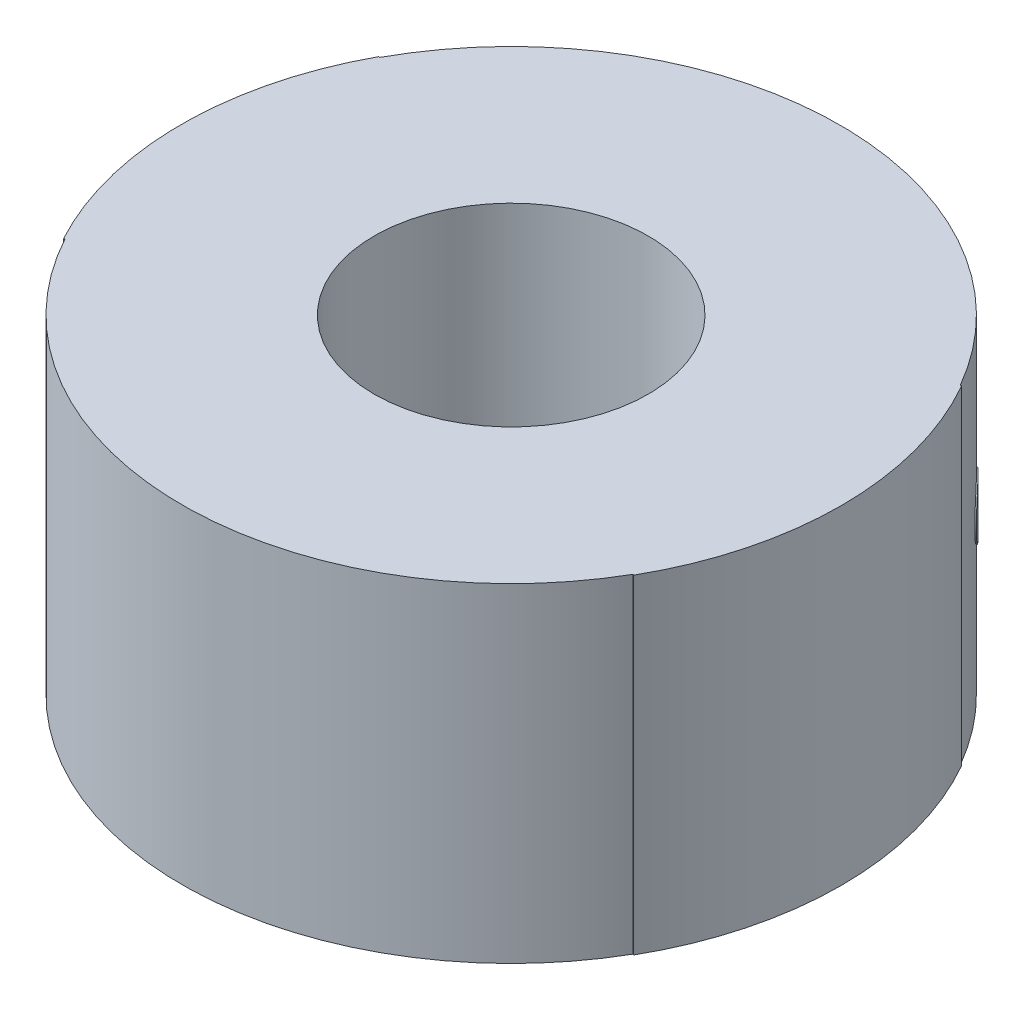
ISO-10303-21;
HEADER;
FILE_DESCRIPTION(('STEP AP214'),'2;1');
FILE_NAME('part.step','',(''),(''),'','','');
FILE_SCHEMA(('AUTOMOTIVE_DESIGN { 1 0 10303 214 1 1 1 1 }'));
ENDSEC;
DATA;
#1=APPLICATION_CONTEXT('core data for automotive mechanical design processes');
#2=APPLICATION_PROTOCOL_DEFINITION('international standard','automotive_design',2000,#1);
#3=PRODUCT_CONTEXT('',#1,'mechanical');
#4=PRODUCT('Part','Part','',(#3));
#5=PRODUCT_RELATED_PRODUCT_CATEGORY('part','',(#4));
#6=PRODUCT_DEFINITION_FORMATION('','',#4);
#7=PRODUCT_DEFINITION_CONTEXT('part definition',#1,'design');
#8=PRODUCT_DEFINITION('design','',#6,#7);
#9=PRODUCT_DEFINITION_SHAPE('','',#8);
#10=(LENGTH_UNIT() NAMED_UNIT(*) SI_UNIT(.MILLI.,.METRE.));
#11=(NAMED_UNIT(*) PLANE_ANGLE_UNIT() SI_UNIT($,.RADIAN.));
#12=(NAMED_UNIT(*) SI_UNIT($,.STERADIAN.) SOLID_ANGLE_UNIT());
#13=UNCERTAINTY_MEASURE_WITH_UNIT(LENGTH_MEASURE(1.E-05),#10,'distance_accuracy_value','');
#14=(GEOMETRIC_REPRESENTATION_CONTEXT(3) GLOBAL_UNCERTAINTY_ASSIGNED_CONTEXT((#13)) GLOBAL_UNIT_ASSIGNED_CONTEXT((#10,
#11,#12)) REPRESENTATION_CONTEXT('',''));
#15=CARTESIAN_POINT('',(0.,0.,0.));
#16=DIRECTION('',(0.,0.,1.));
#17=DIRECTION('',(1.,0.,0.));
#18=AXIS2_PLACEMENT_3D('',#15,#16,#17);
#19=CARTESIAN_POINT('',(0.,3.,0.));
#20=DIRECTION('',(0.,-1.,0.));
#21=DIRECTION('',(0.,0.,-1.));
#22=AXIS2_PLACEMENT_3D('',#19,#20,#21);
#23=CYLINDRICAL_SURFACE('',#22,3.);
#24=CARTESIAN_POINT('',(1.94211216983686,1.5,-2.28652581874152));
#25=CARTESIAN_POINT('',(1.9422034898872,1.5665587849258,-2.2864482540013));
#26=CARTESIAN_POINT('',(1.96239680467796,1.62993034525101,-2.26962366961741));
#27=CARTESIAN_POINT('',(2.0322774795455,1.72362301051194,-2.20727004846032));
#28=CARTESIAN_POINT('',(2.07895572804727,1.74998679026068,-2.16386933616423));
#29=CARTESIAN_POINT('',(2.17243625675623,1.75001320769235,-2.0700019646134));
#30=CARTESIAN_POINT('',(2.21563145984994,1.72360414229513,-2.02315886755828));
#31=CARTESIAN_POINT('',(2.27772070653457,1.62994918270724,-1.95299333134553));
#32=CARTESIAN_POINT('',(2.29445007165519,1.56598267405536,-1.93274387407611));
#33=CARTESIAN_POINT('',(2.29460304992351,1.43401728003895,-1.93256225187676));
#34=CARTESIAN_POINT('',(2.27770838622855,1.37006965979657,-1.95300725499107));
#35=CARTESIAN_POINT('',(2.2156437368506,1.27637695073922,-2.02314499285107));
#36=CARTESIAN_POINT('',(2.17243603206761,1.25001326972375,-2.07000219166791));
#37=CARTESIAN_POINT('',(2.07895588796234,1.24998673162326,-2.16386917415133));
#38=CARTESIAN_POINT('',(2.0322915008972,1.27639565485097,-2.20725753806646));
#39=CARTESIAN_POINT('',(1.96238273507586,1.37005105455172,-2.26963622306448));
#40=CARTESIAN_POINT('',(1.94202084978651,1.4334412150742,-2.28660338348174));
#41=CARTESIAN_POINT('',(1.94211216983686,1.5,-2.28652581874152));
#42=B_SPLINE_CURVE_WITH_KNOTS('',3,(#24,#25,#26,#27,#28,#29,#30,#31,#32,#33,#34,#35,#36,#37,#38,
#39,#40,#41),.UNSPECIFIED.,.T.,.F.,(4,2,2,2,2,2,2,2,4),(0.,0.125,0.25,0.375,0.5,0.625,0.75,
0.875,1.),.UNSPECIFIED.);
#43=CARTESIAN_POINT('',(1.94211216983686,1.5,-2.28652581874152));
#44=VERTEX_POINT('',#43);
#45=EDGE_CURVE('E13',#44,#44,#42,.T.);
#46=ORIENTED_EDGE('',*,*,#45,.F.);
#47=EDGE_LOOP('',(#46));
#48=FACE_BOUND('',#47,.T.);
#49=CARTESIAN_POINT('',(0.,0.,0.));
#50=DIRECTION('',(0.,1.,0.));
#51=DIRECTION('',(0.,0.,1.));
#52=AXIS2_PLACEMENT_3D('',#49,#50,#51);
#53=CIRCLE('',#52,3.);
#54=CARTESIAN_POINT('',(2.60345753903295,0.,-1.49064041353121));
#55=VERTEX_POINT('',#54);
#56=CARTESIAN_POINT('',(-2.63722209020871,0.,-1.43005581951028));
#57=VERTEX_POINT('',#56);
#58=EDGE_CURVE('E329',#55,#57,#53,.T.);
#59=ORIENTED_EDGE('',*,*,#58,.T.);
#60=CARTESIAN_POINT('',(-2.63484992286745,2.99999588517728,-1.4344217943009));
#61=CARTESIAN_POINT('',(-2.63564185033554,1.99999725678485,-1.43296712452628));
#62=CARTESIAN_POINT('',(-2.63643257314415,0.999998628392427,-1.43151179893069));
#63=CARTESIAN_POINT('',(-2.63722209020871,0.,-1.43005581951028));
#64=B_SPLINE_CURVE_WITH_KNOTS('',3,(#60,#61,#62,#63),.UNSPECIFIED.,.F.,.F.,(4,4),(0.,1.),.UNSPECIFIED.);
#65=CARTESIAN_POINT('',(-2.63484992286745,3.,-1.4344217943009));
#66=VERTEX_POINT('',#65);
#67=EDGE_CURVE('E107',#57,#66,#64,.F.);
#68=ORIENTED_EDGE('',*,*,#67,.T.);
#69=CARTESIAN_POINT('',(0.,3.,0.));
#70=DIRECTION('',(0.,1.,0.));
#71=DIRECTION('',(0.,0.,1.));
#72=AXIS2_PLACEMENT_3D('',#69,#70,#71);
#73=CIRCLE('',#72,3.);
#74=CARTESIAN_POINT('',(2.60345753903295,3.,-1.49064041353121));
#75=VERTEX_POINT('',#74);
#76=EDGE_CURVE('E92',#75,#66,#73,.T.);
#77=ORIENTED_EDGE('',*,*,#76,.F.);
#78=DIRECTION('',(0.,1.,0.));
#79=VECTOR('',#78,1.);
#80=CARTESIAN_POINT('',(2.60345753903295,0.,-1.49064041353121));
#81=LINE('',#80,#79);
#82=EDGE_CURVE('E244',#55,#75,#81,.T.);
#83=ORIENTED_EDGE('',*,*,#82,.F.);
#84=EDGE_LOOP('',(#59,#68,#77,#83));
#85=FACE_BOUND('',#84,.T.);
#86=ADVANCED_FACE('F79',(#48,#85),#23,.T.);
#87=CARTESIAN_POINT('',(-2.6348499196088,3.,1.43442180028662));
#88=VERTEX_POINT('',#87);
#89=CARTESIAN_POINT('',(2.60345753903295,3.,1.49064041353121));
#90=VERTEX_POINT('',#89);
#91=EDGE_CURVE('E99',#88,#90,#73,.T.);
#92=ORIENTED_EDGE('',*,*,#91,.F.);
#93=DIRECTION('',(0.,-1.,0.));
#94=VECTOR('',#93,1.);
#95=CARTESIAN_POINT('',(-2.6348499196088,3.,1.43442180028662));
#96=LINE('',#95,#94);
#97=CARTESIAN_POINT('',(-2.6348499196088,0.,1.43442180028662));
#98=VERTEX_POINT('',#97);
#99=EDGE_CURVE('E357',#88,#98,#96,.T.);
#100=ORIENTED_EDGE('',*,*,#99,.T.);
#101=CARTESIAN_POINT('',(2.60345753903295,0.,1.49064041353121));
#102=VERTEX_POINT('',#101);
#103=EDGE_CURVE('E316',#98,#102,#53,.T.);
#104=ORIENTED_EDGE('',*,*,#103,.T.);
#105=DIRECTION('',(0.,-1.,0.));
#106=VECTOR('',#105,1.);
#107=CARTESIAN_POINT('',(2.60345753903295,3.,1.49064041353121));
#108=LINE('',#107,#106);
#109=EDGE_CURVE('E238',#90,#102,#108,.T.);
#110=ORIENTED_EDGE('',*,*,#109,.F.);
#111=EDGE_LOOP('',(#92,#100,#104,#110));
#112=FACE_BOUND('',#111,.T.);
#113=ADVANCED_FACE('F81',(#112),#23,.T.);
#114=CARTESIAN_POINT('',(0.,3.,0.));
#115=DIRECTION('',(0.,1.,0.));
#116=DIRECTION('',(0.,0.,1.));
#117=AXIS2_PLACEMENT_3D('',#114,#115,#116);
#118=PLANE('',#117);
#119=CARTESIAN_POINT('',(0.,3.,0.));
#120=DIRECTION('',(0.,1.,0.));
#121=DIRECTION('',(0.,0.,1.));
#122=AXIS2_PLACEMENT_3D('',#119,#120,#121);
#123=CIRCLE('',#122,1.25);
#124=CARTESIAN_POINT('',(0.,3.,1.25));
#125=VERTEX_POINT('',#124);
#126=EDGE_CURVE('E308',#125,#125,#123,.T.);
#127=ORIENTED_EDGE('',*,*,#126,.F.);
#128=EDGE_LOOP('',(#127));
#129=FACE_BOUND('',#128,.T.);
#130=ORIENTED_EDGE('',*,*,#76,.T.);
#131=CARTESIAN_POINT('',(-2.64363275594367,2.99999588517728,-1.4392032002819));
#132=CARTESIAN_POINT('',(-2.63484992286745,2.99999588517728,-1.4344217943009));
#133=B_SPLINE_CURVE_WITH_KNOTS('',1,(#131,#132),.UNSPECIFIED.,.F.,.F.,(2,2),(0.,1.),.UNSPECIFIED.);
#134=CARTESIAN_POINT('',(-2.64363275594367,2.99999588517728,-1.4392032002819));
#135=VERTEX_POINT('',#134);
#136=EDGE_CURVE('E162',#66,#135,#133,.F.);
#137=ORIENTED_EDGE('',*,*,#136,.T.);
#138=CARTESIAN_POINT('',(0.,2.99999588517728,0.));
#139=DIRECTION('',(0.,-1.,0.));
#140=DIRECTION('',(0.,0.,-1.));
#141=AXIS2_PLACEMENT_3D('',#138,#139,#140);
#142=CIRCLE('',#141,3.01);
#143=CARTESIAN_POINT('',(-2.64363275267416,2.99999588517728,1.43920320628757));
#144=VERTEX_POINT('',#143);
#145=EDGE_CURVE('E180',#135,#144,#142,.F.);
#146=ORIENTED_EDGE('',*,*,#145,.T.);
#147=DIRECTION('',(-0.878283306536267,0.,0.478140600095539));
#148=VECTOR('',#147,1.);
#149=CARTESIAN_POINT('',(-2.6348499196088,3.,1.43442180028662));
#150=LINE('',#149,#148);
#151=EDGE_CURVE('E231',#88,#144,#150,.T.);
#152=ORIENTED_EDGE('',*,*,#151,.F.);
#153=ORIENTED_EDGE('',*,*,#91,.T.);
#154=DIRECTION('',(0.867819179677649,0.,0.496880137843738));
#155=VECTOR('',#154,1.);
#156=CARTESIAN_POINT('',(2.60345753903295,3.,1.49064041353121));
#157=LINE('',#156,#155);
#158=CARTESIAN_POINT('',(2.61213573082973,3.,1.49560921490965));
#159=VERTEX_POINT('',#158);
#160=EDGE_CURVE('E248',#90,#159,#157,.T.);
#161=ORIENTED_EDGE('',*,*,#160,.T.);
#162=CARTESIAN_POINT('',(0.,3.,0.));
#163=DIRECTION('',(0.,-1.,0.));
#164=DIRECTION('',(0.,0.,-1.));
#165=AXIS2_PLACEMENT_3D('',#162,#163,#164);
#166=CIRCLE('',#165,3.01);
#167=CARTESIAN_POINT('',(2.61213573082973,3.,-1.49560921490965));
#168=VERTEX_POINT('',#167);
#169=EDGE_CURVE('E240',#159,#168,#166,.F.);
#170=ORIENTED_EDGE('',*,*,#169,.T.);
#171=DIRECTION('',(0.86781917967765,0.,-0.496880137843737));
#172=VECTOR('',#171,1.);
#173=CARTESIAN_POINT('',(2.60345753903295,3.,-1.49064041353121));
#174=LINE('',#173,#172);
#175=EDGE_CURVE('E258',#75,#168,#174,.T.);
#176=ORIENTED_EDGE('',*,*,#175,.F.);
#177=EDGE_LOOP('',(#130,#137,#146,#152,#153,#161,#170,#176));
#178=FACE_BOUND('',#177,.T.);
#179=ADVANCED_FACE('F353',(#129,#178),#118,.T.);
#180=CARTESIAN_POINT('',(0.,0.,0.));
#181=DIRECTION('',(0.,1.,0.));
#182=DIRECTION('',(0.,0.,1.));
#183=AXIS2_PLACEMENT_3D('',#180,#181,#182);
#184=PLANE('',#183);
#185=CARTESIAN_POINT('',(0.,0.,0.));
#186=DIRECTION('',(0.,1.,0.));
#187=DIRECTION('',(0.,0.,1.));
#188=AXIS2_PLACEMENT_3D('',#185,#186,#187);
#189=CIRCLE('',#188,1.25);
#190=CARTESIAN_POINT('',(0.,0.,1.25));
#191=VERTEX_POINT('',#190);
#192=EDGE_CURVE('E317',#191,#191,#189,.T.);
#193=ORIENTED_EDGE('',*,*,#192,.T.);
#194=EDGE_LOOP('',(#193));
#195=FACE_BOUND('',#194,.T.);
#196=ORIENTED_EDGE('',*,*,#58,.F.);
#197=DIRECTION('',(0.86781917967765,0.,-0.496880137843737));
#198=VECTOR('',#197,1.);
#199=CARTESIAN_POINT('',(2.60345753903295,0.,-1.49064041353121));
#200=LINE('',#199,#198);
#201=CARTESIAN_POINT('',(2.61213573082973,0.,-1.49560921490965));
#202=VERTEX_POINT('',#201);
#203=EDGE_CURVE('E260',#55,#202,#200,.T.);
#204=ORIENTED_EDGE('',*,*,#203,.T.);
#205=CARTESIAN_POINT('',(0.,0.,0.));
#206=DIRECTION('',(0.,-1.,0.));
#207=DIRECTION('',(0.,0.,-1.));
#208=AXIS2_PLACEMENT_3D('',#205,#206,#207);
#209=CIRCLE('',#208,3.01);
#210=CARTESIAN_POINT('',(2.61213573082973,0.,1.49560921490965));
#211=VERTEX_POINT('',#210);
#212=EDGE_CURVE('E249',#211,#202,#209,.F.);
#213=ORIENTED_EDGE('',*,*,#212,.F.);
#214=DIRECTION('',(0.867819179677649,0.,0.496880137843738));
#215=VECTOR('',#214,1.);
#216=CARTESIAN_POINT('',(2.60345753903295,0.,1.49064041353121));
#217=LINE('',#216,#215);
#218=EDGE_CURVE('E262',#102,#211,#217,.T.);
#219=ORIENTED_EDGE('',*,*,#218,.F.);
#220=ORIENTED_EDGE('',*,*,#103,.F.);
#221=DIRECTION('',(-0.878283306536267,0.,0.478140600095539));
#222=VECTOR('',#221,1.);
#223=CARTESIAN_POINT('',(-2.6348499196088,0.,1.43442180028662));
#224=LINE('',#223,#222);
#225=CARTESIAN_POINT('',(-2.64363275267416,0.,1.43920320628757));
#226=VERTEX_POINT('',#225);
#227=EDGE_CURVE('E163',#98,#226,#224,.T.);
#228=ORIENTED_EDGE('',*,*,#227,.T.);
#229=CARTESIAN_POINT('',(0.,0.,0.));
#230=DIRECTION('',(0.,-1.,0.));
#231=DIRECTION('',(0.,0.,-1.));
#232=AXIS2_PLACEMENT_3D('',#229,#230,#231);
#233=CIRCLE('',#232,3.01);
#234=CARTESIAN_POINT('',(-2.64601283050941,0.,-1.43482267224198));
#235=VERTEX_POINT('',#234);
#236=EDGE_CURVE('E167',#235,#226,#233,.F.);
#237=ORIENTED_EDGE('',*,*,#236,.F.);
#238=CARTESIAN_POINT('',(-2.63722209020871,0.,-1.43005581951028));
#239=CARTESIAN_POINT('',(-2.64601283050941,0.,-1.43482267224198));
#240=B_SPLINE_CURVE_WITH_KNOTS('',1,(#238,#239),.UNSPECIFIED.,.F.,.F.,(2,2),(0.,1.),.UNSPECIFIED.);
#241=EDGE_CURVE('E151',#57,#235,#240,.T.);
#242=ORIENTED_EDGE('',*,*,#241,.F.);
#243=EDGE_LOOP('',(#196,#204,#213,#219,#220,#228,#237,#242));
#244=FACE_BOUND('',#243,.T.);
#245=ADVANCED_FACE('F168',(#195,#244),#184,.F.);
#246=CARTESIAN_POINT('',(0.,3.,0.));
#247=DIRECTION('',(0.,-1.,0.));
#248=DIRECTION('',(0.,0.,-1.));
#249=AXIS2_PLACEMENT_3D('',#246,#247,#248);
#250=CYLINDRICAL_SURFACE('',#249,1.25);
#251=ORIENTED_EDGE('',*,*,#126,.T.);
#252=EDGE_LOOP('',(#251));
#253=FACE_BOUND('',#252,.T.);
#254=ORIENTED_EDGE('',*,*,#192,.F.);
#255=EDGE_LOOP('',(#254));
#256=FACE_BOUND('',#255,.T.);
#257=ADVANCED_FACE('F292',(#253,#256),#250,.F.);
#258=CARTESIAN_POINT('',(1.94858587706965,1.5,-2.29414757147066));
#259=CARTESIAN_POINT('',(1.94867750152016,1.5665587849258,-2.29406974818131));
#260=CARTESIAN_POINT('',(1.96893812736022,1.62993034525101,-2.27718908184946));
#261=CARTESIAN_POINT('',(2.03905173781065,1.72362301051194,-2.21462761528852));
#262=CARTESIAN_POINT('',(2.0858855804741,1.74998679026068,-2.17108223395145));
#263=CARTESIAN_POINT('',(2.17967771094542,1.75001320769235,-2.07690197116212));
#264=CARTESIAN_POINT('',(2.22301689804944,1.72360414229513,-2.02990273045014));
#265=CARTESIAN_POINT('',(2.28531310888969,1.62994918270724,-1.95950330911669));
#266=CARTESIAN_POINT('',(2.30209823856071,1.56598267405536,-1.93918635365636));
#267=CARTESIAN_POINT('',(2.30225172675659,1.43401728003895,-1.93900412604968));
#268=CARTESIAN_POINT('',(2.28530074751598,1.37006965979657,-1.95951727917437));
#269=CARTESIAN_POINT('',(2.22302921597343,1.27637695073922,-2.02988880949391));
#270=CARTESIAN_POINT('',(2.17967748550784,1.25001326972375,-2.07690219897347));
#271=CARTESIAN_POINT('',(2.08588574092221,1.24998673162326,-2.1710820713985));
#272=CARTESIAN_POINT('',(2.03906580590019,1.27639565485097,-2.21461506319335));
#273=CARTESIAN_POINT('',(1.96892401085944,1.37005105455172,-2.27720167714136));
#274=CARTESIAN_POINT('',(1.94849425261913,1.4334412150742,-2.29422539476001));
#275=CARTESIAN_POINT('',(1.94858587706965,1.5,-2.29414757147066));
#276=CARTESIAN_POINT('',(1.94211216983686,1.5,-2.28652581874152));
#277=CARTESIAN_POINT('',(1.9422034898872,1.5665587849258,-2.2864482540013));
#278=CARTESIAN_POINT('',(1.96239680467796,1.62993034525101,-2.26962366961741));
#279=CARTESIAN_POINT('',(2.0322774795455,1.72362301051194,-2.20727004846032));
#280=CARTESIAN_POINT('',(2.07895572804727,1.74998679026068,-2.16386933616423));
#281=CARTESIAN_POINT('',(2.17243625675623,1.75001320769235,-2.0700019646134));
#282=CARTESIAN_POINT('',(2.21563145984994,1.72360414229513,-2.02315886755828));
#283=CARTESIAN_POINT('',(2.27772070653457,1.62994918270724,-1.95299333134553));
#284=CARTESIAN_POINT('',(2.29445007165519,1.56598267405536,-1.93274387407611));
#285=CARTESIAN_POINT('',(2.29460304992351,1.43401728003895,-1.93256225187676));
#286=CARTESIAN_POINT('',(2.27770838622855,1.37006965979657,-1.95300725499107));
#287=CARTESIAN_POINT('',(2.2156437368506,1.27637695073922,-2.02314499285107));
#288=CARTESIAN_POINT('',(2.17243603206761,1.25001326972375,-2.07000219166791));
#289=CARTESIAN_POINT('',(2.07895588796234,1.24998673162326,-2.16386917415133));
#290=CARTESIAN_POINT('',(2.0322915008972,1.27639565485097,-2.20725753806646));
#291=CARTESIAN_POINT('',(1.96238273507586,1.37005105455172,-2.26963622306448));
#292=CARTESIAN_POINT('',(1.94202084978651,1.4334412150742,-2.28660338348174));
#293=CARTESIAN_POINT('',(1.94211216983686,1.5,-2.28652581874152));
#294=B_SPLINE_SURFACE_WITH_KNOTS('',1,3,((#258,#259,#260,#261,#262,#263,#264,#265,#266,#267,
#268,#269,#270,#271,#272,#273,#274,#275),(#276,#277,#278,#279,#280,#281,#282,#283,#284,#285,
#286,#287,#288,#289,#290,#291,#292,#293)),.UNSPECIFIED.,.F.,.T.,.F.,(2,2),(4,2,2,2,2,2,2,2,4),
(0.,1.),(0.,0.125,0.25,0.375,0.5,0.625,0.75,0.875,1.),.UNSPECIFIED.);
#295=CARTESIAN_POINT('',(1.94858587706965,1.5,-2.29414757147066));
#296=CARTESIAN_POINT('',(1.94849425261913,1.4334412150742,-2.29422539476001));
#297=CARTESIAN_POINT('',(1.96892401085944,1.37005105455172,-2.27720167714136));
#298=CARTESIAN_POINT('',(2.03906580590019,1.27639565485097,-2.21461506319335));
#299=CARTESIAN_POINT('',(2.08588574092221,1.24998673162326,-2.1710820713985));
#300=CARTESIAN_POINT('',(2.17967748550784,1.25001326972375,-2.07690219897347));
#301=CARTESIAN_POINT('',(2.22302921597343,1.27637695073922,-2.02988880949391));
#302=CARTESIAN_POINT('',(2.28530074751598,1.37006965979657,-1.95951727917437));
#303=CARTESIAN_POINT('',(2.30225172675659,1.43401728003895,-1.93900412604968));
#304=CARTESIAN_POINT('',(2.30209823856071,1.56598267405536,-1.93918635365636));
#305=CARTESIAN_POINT('',(2.28531310888969,1.62994918270724,-1.95950330911669));
#306=CARTESIAN_POINT('',(2.22301689804944,1.72360414229513,-2.02990273045014));
#307=CARTESIAN_POINT('',(2.17967771094542,1.75001320769235,-2.07690197116212));
#308=CARTESIAN_POINT('',(2.0858855804741,1.74998679026068,-2.17108223395145));
#309=CARTESIAN_POINT('',(2.03905173781065,1.72362301051194,-2.21462761528852));
#310=CARTESIAN_POINT('',(1.96893812736022,1.62993034525101,-2.27718908184946));
#311=CARTESIAN_POINT('',(1.94867750152016,1.5665587849258,-2.29406974818131));
#312=CARTESIAN_POINT('',(1.94858587706965,1.5,-2.29414757147066));
#313=B_SPLINE_CURVE_WITH_KNOTS('',3,(#295,#296,#297,#298,#299,#300,#301,#302,#303,#304,#305,
#306,#307,#308,#309,#310,#311,#312),.UNSPECIFIED.,.T.,.F.,(4,2,2,2,2,2,2,2,4),(0.,0.125,0.25,
0.375,0.5,0.625,0.75,0.875,1.),.UNSPECIFIED.);
#314=CARTESIAN_POINT('',(1.94858587706965,1.5,-2.29414757147066));
#315=VERTEX_POINT('',#314);
#316=EDGE_CURVE('E264',#315,#315,#313,.F.);
#317=ORIENTED_EDGE('',*,*,#316,.F.);
#318=EDGE_LOOP('',(#317));
#319=FACE_BOUND('',#318,.T.);
#320=ORIENTED_EDGE('',*,*,#45,.T.);
#321=EDGE_LOOP('',(#320));
#322=FACE_BOUND('',#321,.T.);
#323=ADVANCED_FACE('F283',(#319,#322),#294,.T.);
#324=CARTESIAN_POINT('',(0.,3.,0.));
#325=DIRECTION('',(0.,-1.,0.));
#326=DIRECTION('',(0.,0.,-1.));
#327=AXIS2_PLACEMENT_3D('',#324,#325,#326);
#328=CYLINDRICAL_SURFACE('',#327,3.01);
#329=ORIENTED_EDGE('',*,*,#316,.T.);
#330=EDGE_LOOP('',(#329));
#331=FACE_BOUND('',#330,.T.);
#332=ADVANCED_FACE('F272',(#331),#328,.T.);
#333=CARTESIAN_POINT('',(2.60345753903295,1.5,-1.49064041353121));
#334=DIRECTION('',(-0.496880137843737,0.,-0.86781917967765));
#335=DIRECTION('',(0.,1.,0.));
#336=AXIS2_PLACEMENT_3D('',#333,#334,#335);
#337=PLANE('',#336);
#338=ORIENTED_EDGE('',*,*,#203,.F.);
#339=ORIENTED_EDGE('',*,*,#82,.T.);
#340=ORIENTED_EDGE('',*,*,#175,.T.);
#341=DIRECTION('',(0.,-1.,0.));
#342=VECTOR('',#341,1.);
#343=CARTESIAN_POINT('',(2.61213573082973,3.,-1.49560921490965));
#344=LINE('',#343,#342);
#345=EDGE_CURVE('E245',#202,#168,#344,.F.);
#346=ORIENTED_EDGE('',*,*,#345,.F.);
#347=EDGE_LOOP('',(#338,#339,#340,#346));
#348=FACE_BOUND('',#347,.T.);
#349=ADVANCED_FACE('F282',(#348),#337,.T.);
#350=CARTESIAN_POINT('',(2.60345753903295,1.5,1.49064041353121));
#351=DIRECTION('',(-0.496880137843738,0.,0.867819179677649));
#352=DIRECTION('',(0.,-1.,0.));
#353=AXIS2_PLACEMENT_3D('',#350,#351,#352);
#354=PLANE('',#353);
#355=ORIENTED_EDGE('',*,*,#109,.T.);
#356=ORIENTED_EDGE('',*,*,#218,.T.);
#357=DIRECTION('',(0.,-1.,0.));
#358=VECTOR('',#357,1.);
#359=CARTESIAN_POINT('',(2.61213573082973,3.,1.49560921490965));
#360=LINE('',#359,#358);
#361=EDGE_CURVE('E243',#159,#211,#360,.T.);
#362=ORIENTED_EDGE('',*,*,#361,.F.);
#363=ORIENTED_EDGE('',*,*,#160,.F.);
#364=EDGE_LOOP('',(#355,#356,#362,#363));
#365=FACE_BOUND('',#364,.T.);
#366=ADVANCED_FACE('F285',(#365),#354,.T.);
#367=CARTESIAN_POINT('',(0.,3.,0.));
#368=DIRECTION('',(0.,-1.,0.));
#369=DIRECTION('',(0.,0.,-1.));
#370=AXIS2_PLACEMENT_3D('',#367,#368,#369);
#371=CYLINDRICAL_SURFACE('',#370,3.01);
#372=ORIENTED_EDGE('',*,*,#169,.F.);
#373=ORIENTED_EDGE('',*,*,#361,.T.);
#374=ORIENTED_EDGE('',*,*,#212,.T.);
#375=ORIENTED_EDGE('',*,*,#345,.T.);
#376=EDGE_LOOP('',(#372,#373,#374,#375));
#377=FACE_BOUND('',#376,.T.);
#378=ADVANCED_FACE('F204',(#377),#371,.T.);
#379=CARTESIAN_POINT('',(-2.64601283050941,0.,-1.43482267224198));
#380=CARTESIAN_POINT('',(-2.6452206817213,0.999998628392426,-1.43628350492713));
#381=CARTESIAN_POINT('',(-2.64442732316999,1.99999725678486,-1.43774368160803));
#382=CARTESIAN_POINT('',(-2.64363275594367,2.99999588517728,-1.4392032002819));
#383=CARTESIAN_POINT('',(-2.63722209020871,0.,-1.43005581951028));
#384=CARTESIAN_POINT('',(-2.63643257314415,0.999998628392427,-1.43151179893069));
#385=CARTESIAN_POINT('',(-2.63564185033554,1.99999725678485,-1.43296712452628));
#386=CARTESIAN_POINT('',(-2.63484992286745,2.99999588517728,-1.4344217943009));
#387=B_SPLINE_SURFACE_WITH_KNOTS('',1,3,((#379,#380,#381,#382),(#383,#384,#385,#386)),
.UNSPECIFIED.,.F.,.F.,.F.,(2,2),(4,4),(0.,1.),(0.,1.),.UNSPECIFIED.);
#388=CARTESIAN_POINT('',(-2.64601283050941,0.,-1.43482267224198));
#389=CARTESIAN_POINT('',(-2.6452206817213,0.999998628392426,-1.43628350492713));
#390=CARTESIAN_POINT('',(-2.64442732316999,1.99999725678486,-1.43774368160803));
#391=CARTESIAN_POINT('',(-2.64363275594367,2.99999588517728,-1.4392032002819));
#392=B_SPLINE_CURVE_WITH_KNOTS('',3,(#388,#389,#390,#391),.UNSPECIFIED.,.F.,.F.,(4,4),(0.,1.),.UNSPECIFIED.);
#393=EDGE_CURVE('E157',#235,#135,#392,.T.);
#394=ORIENTED_EDGE('',*,*,#136,.F.);
#395=ORIENTED_EDGE('',*,*,#67,.F.);
#396=ORIENTED_EDGE('',*,*,#241,.T.);
#397=ORIENTED_EDGE('',*,*,#393,.T.);
#398=EDGE_LOOP('',(#394,#395,#396,#397));
#399=FACE_BOUND('',#398,.T.);
#400=ADVANCED_FACE('F155',(#399),#387,.F.);
#401=CARTESIAN_POINT('',(-2.6348499196088,1.5,1.43442180028662));
#402=DIRECTION('',(-0.478140600095539,0.,-0.878283306536267));
#403=DIRECTION('',(0.,-1.,0.));
#404=AXIS2_PLACEMENT_3D('',#401,#402,#403);
#405=PLANE('',#404);
#406=ORIENTED_EDGE('',*,*,#99,.F.);
#407=ORIENTED_EDGE('',*,*,#151,.T.);
#408=DIRECTION('',(0.,-1.,0.));
#409=VECTOR('',#408,1.);
#410=CARTESIAN_POINT('',(-2.64363275267416,3.,1.43920320628757));
#411=LINE('',#410,#409);
#412=EDGE_CURVE('E174',#144,#226,#411,.T.);
#413=ORIENTED_EDGE('',*,*,#412,.T.);
#414=ORIENTED_EDGE('',*,*,#227,.F.);
#415=EDGE_LOOP('',(#406,#407,#413,#414));
#416=FACE_BOUND('',#415,.T.);
#417=ADVANCED_FACE('F198',(#416),#405,.F.);
#418=CARTESIAN_POINT('',(0.,3.,0.));
#419=DIRECTION('',(0.,-1.,0.));
#420=DIRECTION('',(0.,0.,-1.));
#421=AXIS2_PLACEMENT_3D('',#418,#419,#420);
#422=CYLINDRICAL_SURFACE('',#421,3.01);
#423=ORIENTED_EDGE('',*,*,#236,.T.);
#424=ORIENTED_EDGE('',*,*,#412,.F.);
#425=ORIENTED_EDGE('',*,*,#145,.F.);
#426=ORIENTED_EDGE('',*,*,#393,.F.);
#427=EDGE_LOOP('',(#423,#424,#425,#426));
#428=FACE_BOUND('',#427,.T.);
#429=ADVANCED_FACE('F178',(#428),#422,.T.);
#430=CLOSED_SHELL('',(#86,#113,#179,#245,#257,#323,#332,#349,#366,#378,#400,#417,#429));
#431=MANIFOLD_SOLID_BREP('B2',#430);
#432=ADVANCED_BREP_SHAPE_REPRESENTATION('',(#18,#431),#14);
#433=SHAPE_DEFINITION_REPRESENTATION(#9,#432);
ENDSEC;
END-ISO-10303-21;
